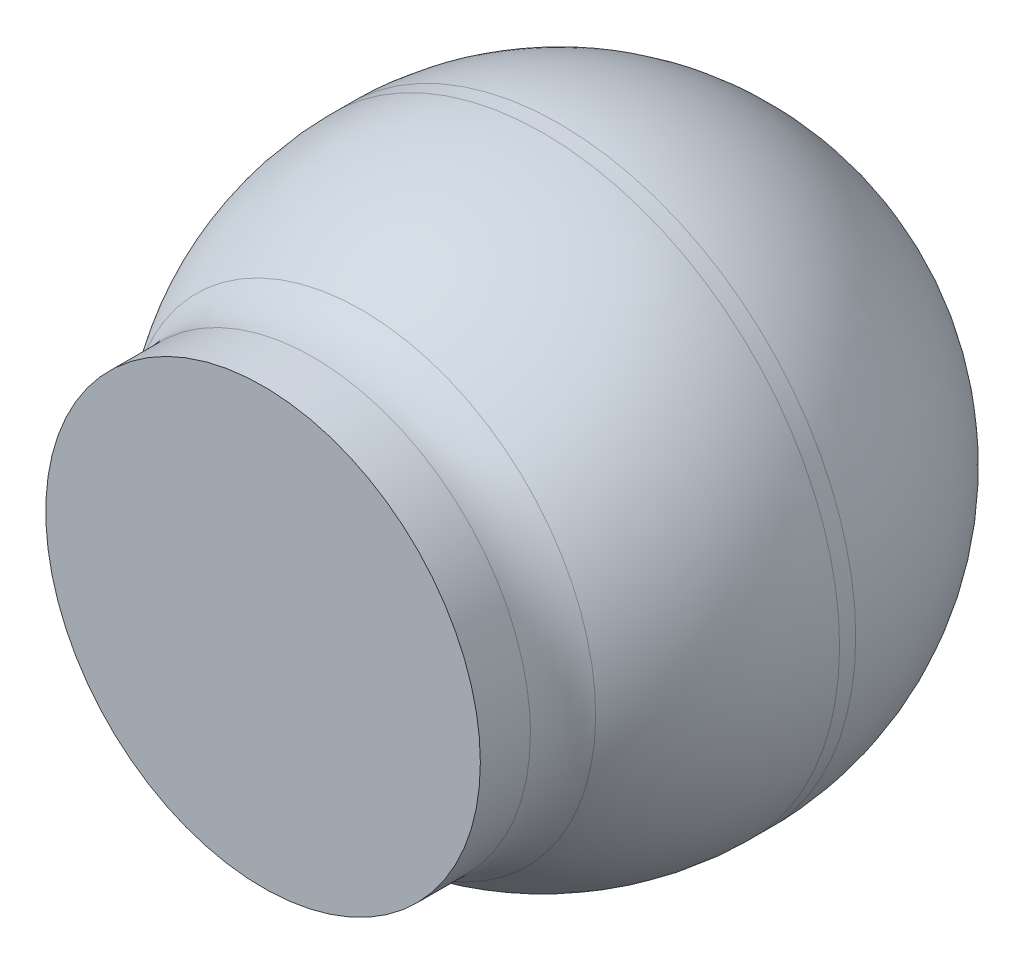
ISO-10303-21;
HEADER;
FILE_DESCRIPTION(('STEP AP214'),'2;1');
FILE_NAME('part.step','',(''),(''),'','','');
FILE_SCHEMA(('AUTOMOTIVE_DESIGN { 1 0 10303 214 1 1 1 1 }'));
ENDSEC;
DATA;
#1=APPLICATION_CONTEXT('core data for automotive mechanical design processes');
#2=APPLICATION_PROTOCOL_DEFINITION('international standard','automotive_design',2000,#1);
#3=PRODUCT_CONTEXT('',#1,'mechanical');
#4=PRODUCT('Part','Part','',(#3));
#5=PRODUCT_RELATED_PRODUCT_CATEGORY('part','',(#4));
#6=PRODUCT_DEFINITION_FORMATION('','',#4);
#7=PRODUCT_DEFINITION_CONTEXT('part definition',#1,'design');
#8=PRODUCT_DEFINITION('design','',#6,#7);
#9=PRODUCT_DEFINITION_SHAPE('','',#8);
#10=(LENGTH_UNIT() NAMED_UNIT(*) SI_UNIT(.MILLI.,.METRE.));
#11=(NAMED_UNIT(*) PLANE_ANGLE_UNIT() SI_UNIT($,.RADIAN.));
#12=(NAMED_UNIT(*) SI_UNIT($,.STERADIAN.) SOLID_ANGLE_UNIT());
#13=UNCERTAINTY_MEASURE_WITH_UNIT(LENGTH_MEASURE(1.E-05),#10,'distance_accuracy_value','');
#14=(GEOMETRIC_REPRESENTATION_CONTEXT(3) GLOBAL_UNCERTAINTY_ASSIGNED_CONTEXT((#13)) GLOBAL_UNIT_ASSIGNED_CONTEXT((#10,
#11,#12)) REPRESENTATION_CONTEXT('',''));
#15=CARTESIAN_POINT('',(0.,0.,0.));
#16=DIRECTION('',(0.,0.,1.));
#17=DIRECTION('',(1.,0.,0.));
#18=AXIS2_PLACEMENT_3D('',#15,#16,#17);
#19=CARTESIAN_POINT('',(-8.182919922269,-2.781349291452,10.006534503384));
#20=DIRECTION('',(0.,0.,-1.));
#21=DIRECTION('',(-1.,0.,0.));
#22=AXIS2_PLACEMENT_3D('',#19,#20,#21);
#23=PLANE('',#22);
#24=CARTESIAN_POINT('',(-8.182919922269,-2.781349291452,10.006534503384));
#25=DIRECTION('',(0.,0.,1.));
#26=DIRECTION('',(1.,0.,0.));
#27=AXIS2_PLACEMENT_3D('',#24,#25,#26);
#28=CIRCLE('',#27,0.275);
#29=CARTESIAN_POINT('',(-7.907919922269,-2.781349291452,10.006534503384));
#30=VERTEX_POINT('',#29);
#31=EDGE_CURVE('E20',#30,#30,#28,.F.);
#32=ORIENTED_EDGE('',*,*,#31,.F.);
#33=EDGE_LOOP('',(#32));
#34=FACE_BOUND('',#33,.T.);
#35=ADVANCED_FACE('F17',(#34),#23,.F.);
#36=CARTESIAN_POINT('',(-8.182919922269,-2.781349291452,9.906534503384));
#37=DIRECTION('',(0.,0.,1.));
#38=DIRECTION('',(1.,0.,0.));
#39=AXIS2_PLACEMENT_3D('',#36,#37,#38);
#40=CYLINDRICAL_SURFACE('',#39,0.275);
#41=CARTESIAN_POINT('',(-8.182919922269,-2.781349291452,9.943180457728));
#42=DIRECTION('',(0.,0.,-1.));
#43=DIRECTION('',(0.996700902337582,0.0811622527992452,0.));
#44=AXIS2_PLACEMENT_3D('',#41,#42,#43);
#45=CIRCLE('',#44,0.275000000000001);
#46=CARTESIAN_POINT('',(-7.90882717412616,-2.75902967193221,9.943180457728));
#47=VERTEX_POINT('',#46);
#48=EDGE_CURVE('E65',#47,#47,#45,.F.);
#49=ORIENTED_EDGE('',*,*,#48,.T.);
#50=EDGE_LOOP('',(#49));
#51=FACE_BOUND('',#50,.T.);
#52=ORIENTED_EDGE('',*,*,#31,.T.);
#53=EDGE_LOOP('',(#52));
#54=FACE_BOUND('',#53,.T.);
#55=ADVANCED_FACE('F62',(#51,#54),#40,.T.);
#56=CARTESIAN_POINT('',(-8.182919922269,-2.781349291452,9.943180457728));
#57=DIRECTION('',(0.,0.,-1.));
#58=DIRECTION('',(0.996700902337583,0.081162252799246,0.));
#59=AXIS2_PLACEMENT_3D('',#56,#57,#58);
#60=TOROIDAL_SURFACE('',#59,0.375,0.1);
#61=ORIENTED_EDGE('',*,*,#48,.F.);
#62=EDGE_LOOP('',(#61));
#63=FACE_BOUND('',#62,.T.);
#64=CARTESIAN_POINT('',(-8.182919922269,-2.781349291452,9.881744931236));
#65=DIRECTION('',(0.,0.,-1.));
#66=DIRECTION('',(-0.996700902337598,-0.0811622527990613,0.));
#67=AXIS2_PLACEMENT_3D('',#64,#65,#66);
#68=CIRCLE('',#67,0.296097046412663);
#69=CARTESIAN_POINT('',(-8.478040115608,-2.805381194786,9.881744931236));
#70=VERTEX_POINT('',#69);
#71=EDGE_CURVE('E39',#70,#70,#68,.T.);
#72=ORIENTED_EDGE('',*,*,#71,.F.);
#73=EDGE_LOOP('',(#72));
#74=FACE_BOUND('',#73,.T.);
#75=ADVANCED_FACE('F57',(#63,#74),#60,.F.);
#76=CARTESIAN_POINT('',(-8.556682760645,-2.811785136252,9.651976062157));
#77=CARTESIAN_POINT('',(-8.556682760645,-2.811785136252,9.701461392103));
#78=CARTESIAN_POINT('',(-8.548526217348,-2.811120941579,9.750947004335));
#79=CARTESIAN_POINT('',(-8.532207085349,-2.809792059952,9.798626332798));
#80=CARTESIAN_POINT('',(-8.508341390838,-2.807848654938,9.842699544317));
#81=CARTESIAN_POINT('',(-8.478040115608,-2.805381194786,9.881744931236));
#82=(BOUNDED_CURVE() B_SPLINE_CURVE(5,(#76,#77,#78,#79,#80,#81),.UNSPECIFIED.,.F.,
.F.) B_SPLINE_CURVE_WITH_KNOTS((6,6),(0.,0.661568582165),
.UNSPECIFIED.) CURVE() GEOMETRIC_REPRESENTATION_ITEM() RATIONAL_B_SPLINE_CURVE((1.,1.,1.,1.,1.,1.)) REPRESENTATION_ITEM(''));
#83=CARTESIAN_POINT('',(-8.182919922269,-2.781349291452,9.651976062157));
#84=DIRECTION('',(0.,0.,-1.));
#85=AXIS1_PLACEMENT('',#83,#84);
#86=SURFACE_OF_REVOLUTION('',#82,#85);
#87=CARTESIAN_POINT('',(-8.182919922269,-2.781349291452,9.651976062157));
#88=DIRECTION('',(0.,0.,1.));
#89=DIRECTION('',(1.,0.,0.));
#90=AXIS2_PLACEMENT_3D('',#87,#88,#89);
#91=CIRCLE('',#90,0.375);
#92=CARTESIAN_POINT('',(-7.807919922269,-2.781349291452,9.651976062157));
#93=VERTEX_POINT('',#92);
#94=EDGE_CURVE('E36',#93,#93,#91,.F.);
#95=ORIENTED_EDGE('',*,*,#94,.F.);
#96=EDGE_LOOP('',(#95));
#97=FACE_BOUND('',#96,.T.);
#98=ORIENTED_EDGE('',*,*,#71,.T.);
#99=EDGE_LOOP('',(#98));
#100=FACE_BOUND('',#99,.T.);
#101=ADVANCED_FACE('F53',(#97,#100),#86,.F.);
#102=CARTESIAN_POINT('',(-8.182919922269,-2.781349291452,9.256534503384));
#103=DIRECTION('',(0.,0.,1.));
#104=DIRECTION('',(1.,0.,0.));
#105=AXIS2_PLACEMENT_3D('',#102,#103,#104);
#106=CYLINDRICAL_SURFACE('',#105,0.375);
#107=CARTESIAN_POINT('',(-8.182919922269,-2.781349291452,9.631534503384));
#108=DIRECTION('',(0.,0.,-1.));
#109=DIRECTION('',(0.0811622527992356,-0.996700902337583,0.));
#110=AXIS2_PLACEMENT_3D('',#107,#108,#109);
#111=CIRCLE('',#110,0.375);
#112=CARTESIAN_POINT('',(-8.15248407746929,-3.15511212982859,9.631534503384));
#113=VERTEX_POINT('',#112);
#114=CARTESIAN_POINT('',(-8.21335576706871,-2.40758645307541,9.631534503384));
#115=VERTEX_POINT('',#114);
#116=EDGE_CURVE('E11',#113,#115,#111,.T.);
#117=ORIENTED_EDGE('',*,*,#116,.F.);
#118=CARTESIAN_POINT('',(-8.182919922269,-2.781349291452,9.631534503384));
#119=DIRECTION('',(3.33436315446763E-12,2.72100352061447E-13,1.));
#120=DIRECTION('',(0.0811622527992366,-0.996700902337583,0.));
#121=AXIS2_PLACEMENT_3D('',#118,#119,#120);
#122=CIRCLE('',#121,0.375);
#123=EDGE_CURVE('E25',#115,#113,#122,.F.);
#124=ORIENTED_EDGE('',*,*,#123,.F.);
#125=EDGE_LOOP('',(#117,#124));
#126=FACE_BOUND('',#125,.T.);
#127=ORIENTED_EDGE('',*,*,#94,.T.);
#128=EDGE_LOOP('',(#127));
#129=FACE_BOUND('',#128,.T.);
#130=ADVANCED_FACE('F34',(#126,#129),#106,.T.);
#131=CARTESIAN_POINT('',(-8.182919922269,-2.781349291452,9.631534503384));
#132=DIRECTION('',(0.0811622527992361,-0.996700902337583,0.));
#133=DIRECTION('',(-0.996700902337583,-0.0811622527992361,0.));
#134=AXIS2_PLACEMENT_3D('',#131,#132,#133);
#135=SPHERICAL_SURFACE('',#134,0.375);
#136=ORIENTED_EDGE('',*,*,#123,.T.);
#137=ORIENTED_EDGE('',*,*,#116,.T.);
#138=EDGE_LOOP('',(#136,#137));
#139=FACE_BOUND('',#138,.T.);
#140=ADVANCED_FACE('F32',(#139),#135,.T.);
#141=CLOSED_SHELL('',(#35,#55,#75,#101,#130,#140));
#142=MANIFOLD_SOLID_BREP('B1',#141);
#143=ADVANCED_BREP_SHAPE_REPRESENTATION('',(#18,#142),#14);
#144=SHAPE_DEFINITION_REPRESENTATION(#9,#143);
ENDSEC;
END-ISO-10303-21;
